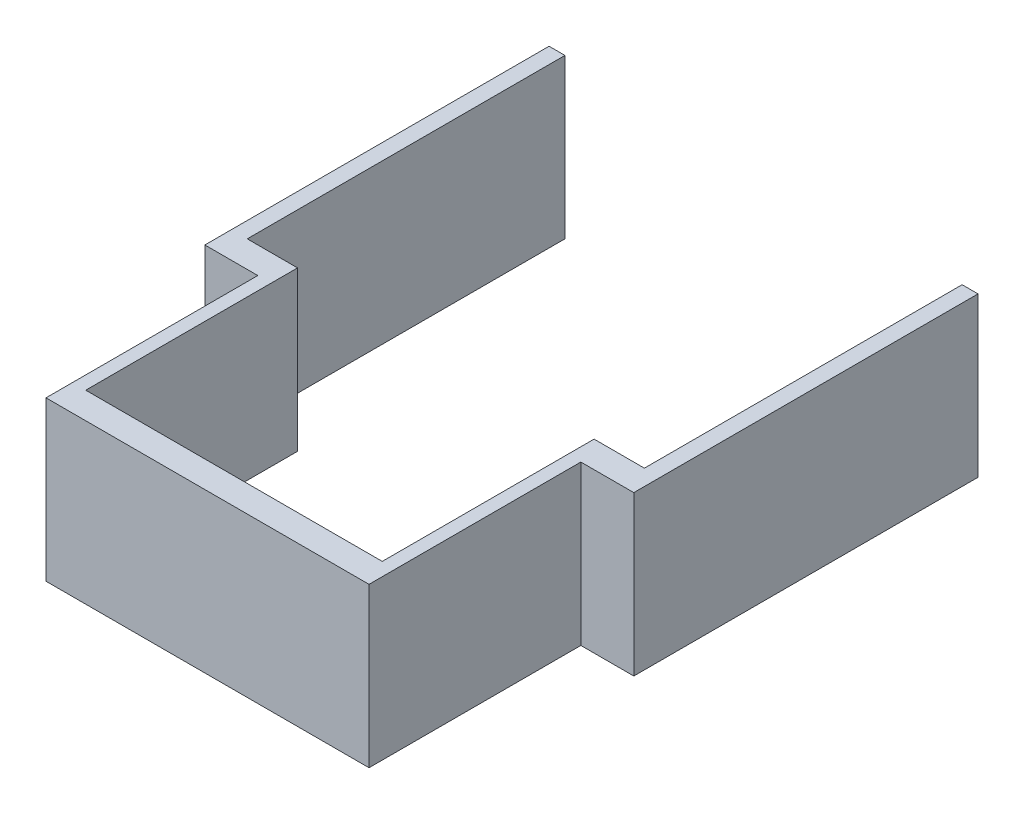
ISO-10303-21;
HEADER;
FILE_DESCRIPTION(('STEP AP214'),'2;1');
FILE_NAME('part.step','',(''),(''),'','','');
FILE_SCHEMA(('AUTOMOTIVE_DESIGN { 1 0 10303 214 1 1 1 1 }'));
ENDSEC;
DATA;
#1=APPLICATION_CONTEXT('core data for automotive mechanical design processes');
#2=APPLICATION_PROTOCOL_DEFINITION('international standard','automotive_design',2000,#1);
#3=PRODUCT_CONTEXT('',#1,'mechanical');
#4=PRODUCT('Part','Part','',(#3));
#5=PRODUCT_RELATED_PRODUCT_CATEGORY('part','',(#4));
#6=PRODUCT_DEFINITION_FORMATION('','',#4);
#7=PRODUCT_DEFINITION_CONTEXT('part definition',#1,'design');
#8=PRODUCT_DEFINITION('design','',#6,#7);
#9=PRODUCT_DEFINITION_SHAPE('','',#8);
#10=(LENGTH_UNIT() NAMED_UNIT(*) SI_UNIT(.MILLI.,.METRE.));
#11=(NAMED_UNIT(*) PLANE_ANGLE_UNIT() SI_UNIT($,.RADIAN.));
#12=(NAMED_UNIT(*) SI_UNIT($,.STERADIAN.) SOLID_ANGLE_UNIT());
#13=UNCERTAINTY_MEASURE_WITH_UNIT(LENGTH_MEASURE(1.E-05),#10,'distance_accuracy_value','');
#14=(GEOMETRIC_REPRESENTATION_CONTEXT(3) GLOBAL_UNCERTAINTY_ASSIGNED_CONTEXT((#13)) GLOBAL_UNIT_ASSIGNED_CONTEXT((#10,
#11,#12)) REPRESENTATION_CONTEXT('',''));
#15=CARTESIAN_POINT('',(0.,0.,0.));
#16=DIRECTION('',(0.,0.,1.));
#17=DIRECTION('',(1.,0.,0.));
#18=AXIS2_PLACEMENT_3D('',#15,#16,#17);
#19=CARTESIAN_POINT('',(0.,0.,0.));
#20=DIRECTION('',(0.,0.,1.));
#21=DIRECTION('',(1.,0.,0.));
#22=AXIS2_PLACEMENT_3D('',#19,#20,#21);
#23=PLANE('',#22);
#24=DIRECTION('',(0.,-1.,0.));
#25=VECTOR('',#24,1.);
#26=CARTESIAN_POINT('',(-39.9083668938455,-14.3559479553903,0.));
#27=LINE('',#26,#25);
#28=CARTESIAN_POINT('',(-39.9083668938455,15.6440520446097,0.));
#29=VERTEX_POINT('',#28);
#30=CARTESIAN_POINT('',(-39.9083668938455,-14.3559479553903,0.));
#31=VERTEX_POINT('',#30);
#32=EDGE_CURVE('E176',#29,#31,#27,.T.);
#33=ORIENTED_EDGE('',*,*,#32,.F.);
#34=DIRECTION('',(-1.,0.,0.));
#35=VECTOR('',#34,1.);
#36=CARTESIAN_POINT('',(-32.9083668938455,15.6440520446097,0.));
#37=LINE('',#36,#35);
#38=CARTESIAN_POINT('',(-30.4083668938455,15.6440520446097,0.));
#39=VERTEX_POINT('',#38);
#40=EDGE_CURVE('E267',#39,#29,#37,.T.);
#41=ORIENTED_EDGE('',*,*,#40,.F.);
#42=DIRECTION('',(0.,1.,0.));
#43=VECTOR('',#42,1.);
#44=CARTESIAN_POINT('',(-30.4083668938455,-14.3559479553903,0.));
#45=LINE('',#44,#43);
#46=CARTESIAN_POINT('',(-30.4083668938455,-14.3559479553903,0.));
#47=VERTEX_POINT('',#46);
#48=EDGE_CURVE('E225',#47,#39,#45,.T.);
#49=ORIENTED_EDGE('',*,*,#48,.F.);
#50=DIRECTION('',(1.,0.,0.));
#51=VECTOR('',#50,1.);
#52=CARTESIAN_POINT('',(-32.9083668938455,-14.3559479553903,0.));
#53=LINE('',#52,#51);
#54=EDGE_CURVE('E265',#31,#47,#53,.T.);
#55=ORIENTED_EDGE('',*,*,#54,.F.);
#56=EDGE_LOOP('',(#33,#41,#49,#55));
#57=FACE_BOUND('',#56,.T.);
#58=ADVANCED_FACE('F36',(#57),#23,.F.);
#59=DIRECTION('',(0.,1.,0.));
#60=VECTOR('',#59,1.);
#61=CARTESIAN_POINT('',(35.0916331061545,-14.3559479553903,0.));
#62=LINE('',#61,#60);
#63=CARTESIAN_POINT('',(35.0916331061545,-14.3559479553903,0.));
#64=VERTEX_POINT('',#63);
#65=CARTESIAN_POINT('',(35.0916331061545,15.6440520446097,0.));
#66=VERTEX_POINT('',#65);
#67=EDGE_CURVE('E186',#64,#66,#62,.T.);
#68=ORIENTED_EDGE('',*,*,#67,.F.);
#69=CARTESIAN_POINT('',(25.5916331061545,-14.3559479553903,0.));
#70=VERTEX_POINT('',#69);
#71=EDGE_CURVE('E245',#70,#64,#53,.T.);
#72=ORIENTED_EDGE('',*,*,#71,.F.);
#73=DIRECTION('',(0.,-1.,0.));
#74=VECTOR('',#73,1.);
#75=CARTESIAN_POINT('',(25.5916331061545,-14.3559479553903,0.));
#76=LINE('',#75,#74);
#77=CARTESIAN_POINT('',(25.5916331061545,15.6440520446097,0.));
#78=VERTEX_POINT('',#77);
#79=EDGE_CURVE('E230',#78,#70,#76,.T.);
#80=ORIENTED_EDGE('',*,*,#79,.F.);
#81=EDGE_CURVE('E258',#66,#78,#37,.T.);
#82=ORIENTED_EDGE('',*,*,#81,.F.);
#83=EDGE_LOOP('',(#68,#72,#80,#82));
#84=FACE_BOUND('',#83,.T.);
#85=ADVANCED_FACE('F303',(#84),#23,.F.);
#86=CARTESIAN_POINT('',(-32.9083668938455,15.6440520446097,45.));
#87=DIRECTION('',(1.,0.,0.));
#88=DIRECTION('',(0.,0.,-1.));
#89=AXIS2_PLACEMENT_3D('',#86,#87,#88);
#90=PLANE('',#89);
#91=DIRECTION('',(0.,1.,0.));
#92=VECTOR('',#91,1.);
#93=CARTESIAN_POINT('',(-32.9083668938455,15.6440520446097,5.));
#94=LINE('',#93,#92);
#95=CARTESIAN_POINT('',(-32.9083668938455,-14.3559479553903,5.00000000000002));
#96=VERTEX_POINT('',#95);
#97=CARTESIAN_POINT('',(-32.9083668938455,15.6440520446097,5.));
#98=VERTEX_POINT('',#97);
#99=EDGE_CURVE('E51',#96,#98,#94,.T.);
#100=ORIENTED_EDGE('',*,*,#99,.F.);
#101=DIRECTION('',(0.,0.,-1.));
#102=VECTOR('',#101,1.);
#103=CARTESIAN_POINT('',(-32.9083668938455,-14.3559479553903,45.));
#104=LINE('',#103,#102);
#105=CARTESIAN_POINT('',(-32.9083668938455,-14.3559479553903,45.));
#106=VERTEX_POINT('',#105);
#107=EDGE_CURVE('E11',#106,#96,#104,.T.);
#108=ORIENTED_EDGE('',*,*,#107,.F.);
#109=DIRECTION('',(0.,-1.,0.));
#110=VECTOR('',#109,1.);
#111=CARTESIAN_POINT('',(-32.9083668938455,15.6440520446097,45.));
#112=LINE('',#111,#110);
#113=CARTESIAN_POINT('',(-32.9083668938455,15.6440520446097,45.));
#114=VERTEX_POINT('',#113);
#115=EDGE_CURVE('E254',#114,#106,#112,.T.);
#116=ORIENTED_EDGE('',*,*,#115,.F.);
#117=DIRECTION('',(0.,0.,-1.));
#118=VECTOR('',#117,1.);
#119=CARTESIAN_POINT('',(-32.9083668938455,15.6440520446097,45.));
#120=LINE('',#119,#118);
#121=EDGE_CURVE('E264',#114,#98,#120,.T.);
#122=ORIENTED_EDGE('',*,*,#121,.T.);
#123=EDGE_LOOP('',(#100,#108,#116,#122));
#124=FACE_BOUND('',#123,.T.);
#125=ADVANCED_FACE('F38',(#124),#90,.F.);
#126=CARTESIAN_POINT('',(28.0916331061545,15.6440520446097,45.));
#127=DIRECTION('',(-1.,0.,0.));
#128=DIRECTION('',(0.,-1.,0.));
#129=AXIS2_PLACEMENT_3D('',#126,#127,#128);
#130=PLANE('',#129);
#131=DIRECTION('',(0.,-1.,0.));
#132=VECTOR('',#131,1.);
#133=CARTESIAN_POINT('',(28.0916331061545,-14.3559479553903,5.));
#134=LINE('',#133,#132);
#135=CARTESIAN_POINT('',(28.0916331061545,15.6440520446097,5.00000000000001));
#136=VERTEX_POINT('',#135);
#137=CARTESIAN_POINT('',(28.0916331061545,-14.3559479553903,5.));
#138=VERTEX_POINT('',#137);
#139=EDGE_CURVE('E58',#136,#138,#134,.T.);
#140=ORIENTED_EDGE('',*,*,#139,.F.);
#141=DIRECTION('',(0.,0.,-1.));
#142=VECTOR('',#141,1.);
#143=CARTESIAN_POINT('',(28.0916331061545,15.6440520446097,45.));
#144=LINE('',#143,#142);
#145=CARTESIAN_POINT('',(28.0916331061545,15.6440520446097,45.));
#146=VERTEX_POINT('',#145);
#147=EDGE_CURVE('E270',#146,#136,#144,.T.);
#148=ORIENTED_EDGE('',*,*,#147,.F.);
#149=DIRECTION('',(0.,1.,0.));
#150=VECTOR('',#149,1.);
#151=CARTESIAN_POINT('',(28.0916331061545,15.6440520446097,45.));
#152=LINE('',#151,#150);
#153=CARTESIAN_POINT('',(28.0916331061545,-14.3559479553903,45.));
#154=VERTEX_POINT('',#153);
#155=EDGE_CURVE('E260',#154,#146,#152,.T.);
#156=ORIENTED_EDGE('',*,*,#155,.F.);
#157=DIRECTION('',(0.,0.,-1.));
#158=VECTOR('',#157,1.);
#159=CARTESIAN_POINT('',(28.0916331061545,-14.3559479553903,45.));
#160=LINE('',#159,#158);
#161=EDGE_CURVE('E44',#154,#138,#160,.T.);
#162=ORIENTED_EDGE('',*,*,#161,.T.);
#163=EDGE_LOOP('',(#140,#148,#156,#162));
#164=FACE_BOUND('',#163,.T.);
#165=ADVANCED_FACE('F273',(#164),#130,.F.);
#166=CARTESIAN_POINT('',(-32.9083668938455,-14.3559479553903,45.));
#167=DIRECTION('',(0.,1.,0.));
#168=DIRECTION('',(0.,0.,1.));
#169=AXIS2_PLACEMENT_3D('',#166,#167,#168);
#170=PLANE('',#169);
#171=DIRECTION('',(0.,0.,1.));
#172=VECTOR('',#171,1.);
#173=CARTESIAN_POINT('',(-42.9083668938455,-14.3559479553903,5.));
#174=LINE('',#173,#172);
#175=CARTESIAN_POINT('',(-42.9083668938455,-14.3559479553903,-60.));
#176=VERTEX_POINT('',#175);
#177=CARTESIAN_POINT('',(-42.9083668938455,-14.3559479553903,5.));
#178=VERTEX_POINT('',#177);
#179=EDGE_CURVE('E160',#176,#178,#174,.T.);
#180=ORIENTED_EDGE('',*,*,#179,.F.);
#181=DIRECTION('',(-1.,0.,0.));
#182=VECTOR('',#181,1.);
#183=CARTESIAN_POINT('',(-42.9083668938455,-14.3559479553903,-60.));
#184=LINE('',#183,#182);
#185=CARTESIAN_POINT('',(-39.9083668938455,-14.3559479553903,-60.));
#186=VERTEX_POINT('',#185);
#187=EDGE_CURVE('E175',#186,#176,#184,.T.);
#188=ORIENTED_EDGE('',*,*,#187,.F.);
#189=DIRECTION('',(0.,0.,1.));
#190=VECTOR('',#189,1.);
#191=CARTESIAN_POINT('',(-39.9083668938455,-14.3559479553903,-60.));
#192=LINE('',#191,#190);
#193=EDGE_CURVE('E181',#186,#31,#192,.T.);
#194=ORIENTED_EDGE('',*,*,#193,.T.);
#195=ORIENTED_EDGE('',*,*,#54,.T.);
#196=DIRECTION('',(0.,0.,-1.));
#197=VECTOR('',#196,1.);
#198=CARTESIAN_POINT('',(-30.4083668938455,-14.3559479553903,40.));
#199=LINE('',#198,#197);
#200=CARTESIAN_POINT('',(-30.4083668938455,-14.3559479553903,40.));
#201=VERTEX_POINT('',#200);
#202=EDGE_CURVE('E242',#201,#47,#199,.T.);
#203=ORIENTED_EDGE('',*,*,#202,.F.);
#204=DIRECTION('',(-1.,0.,0.));
#205=VECTOR('',#204,1.);
#206=CARTESIAN_POINT('',(-30.4083668938455,-14.3559479553903,40.));
#207=LINE('',#206,#205);
#208=CARTESIAN_POINT('',(25.5916331061545,-14.3559479553903,40.));
#209=VERTEX_POINT('',#208);
#210=EDGE_CURVE('E236',#209,#201,#207,.T.);
#211=ORIENTED_EDGE('',*,*,#210,.F.);
#212=DIRECTION('',(0.,0.,-1.));
#213=VECTOR('',#212,1.);
#214=CARTESIAN_POINT('',(25.5916331061545,-14.3559479553903,40.));
#215=LINE('',#214,#213);
#216=EDGE_CURVE('E246',#209,#70,#215,.T.);
#217=ORIENTED_EDGE('',*,*,#216,.T.);
#218=ORIENTED_EDGE('',*,*,#71,.T.);
#219=DIRECTION('',(0.,0.,1.));
#220=VECTOR('',#219,1.);
#221=CARTESIAN_POINT('',(35.0916331061545,-14.3559479553903,-60.));
#222=LINE('',#221,#220);
#223=CARTESIAN_POINT('',(35.0916331061545,-14.3559479553903,-60.));
#224=VERTEX_POINT('',#223);
#225=EDGE_CURVE('E201',#224,#64,#222,.T.);
#226=ORIENTED_EDGE('',*,*,#225,.F.);
#227=DIRECTION('',(-1.,0.,0.));
#228=VECTOR('',#227,1.);
#229=CARTESIAN_POINT('',(38.0916331061545,-14.3559479553903,-60.));
#230=LINE('',#229,#228);
#231=CARTESIAN_POINT('',(38.0916331061545,-14.3559479553903,-60.));
#232=VERTEX_POINT('',#231);
#233=EDGE_CURVE('E190',#232,#224,#230,.T.);
#234=ORIENTED_EDGE('',*,*,#233,.F.);
#235=DIRECTION('',(0.,0.,-1.));
#236=VECTOR('',#235,1.);
#237=CARTESIAN_POINT('',(38.0916331061545,-14.3559479553903,5.));
#238=LINE('',#237,#236);
#239=CARTESIAN_POINT('',(38.0916331061545,-14.3559479553903,5.));
#240=VERTEX_POINT('',#239);
#241=EDGE_CURVE('E214',#240,#232,#238,.T.);
#242=ORIENTED_EDGE('',*,*,#241,.F.);
#243=DIRECTION('',(-1.,0.,0.));
#244=VECTOR('',#243,1.);
#245=CARTESIAN_POINT('',(38.0916331061545,-14.3559479553903,5.));
#246=LINE('',#245,#244);
#247=EDGE_CURVE('E222',#240,#138,#246,.T.);
#248=ORIENTED_EDGE('',*,*,#247,.T.);
#249=ORIENTED_EDGE('',*,*,#161,.F.);
#250=DIRECTION('',(1.,0.,0.));
#251=VECTOR('',#250,1.);
#252=CARTESIAN_POINT('',(-32.9083668938455,-14.3559479553903,45.));
#253=LINE('',#252,#251);
#254=EDGE_CURVE('E257',#106,#154,#253,.T.);
#255=ORIENTED_EDGE('',*,*,#254,.F.);
#256=ORIENTED_EDGE('',*,*,#107,.T.);
#257=DIRECTION('',(1.,0.,0.));
#258=VECTOR('',#257,1.);
#259=CARTESIAN_POINT('',(-42.9083668938455,-14.3559479553903,5.));
#260=LINE('',#259,#258);
#261=EDGE_CURVE('E205',#178,#96,#260,.T.);
#262=ORIENTED_EDGE('',*,*,#261,.F.);
#263=EDGE_LOOP('',(#180,#188,#194,#195,#203,#211,#217,#218,#226,#234,#242,#248,#249,#255,#256,#262));
#264=FACE_BOUND('',#263,.T.);
#265=ADVANCED_FACE('F276',(#264),#170,.F.);
#266=CARTESIAN_POINT('',(-32.9083668938455,15.6440520446097,45.));
#267=DIRECTION('',(0.,-1.,0.));
#268=DIRECTION('',(0.,0.,-1.));
#269=AXIS2_PLACEMENT_3D('',#266,#267,#268);
#270=PLANE('',#269);
#271=DIRECTION('',(1.,0.,0.));
#272=VECTOR('',#271,1.);
#273=CARTESIAN_POINT('',(-30.4083668938455,15.6440520446097,40.));
#274=LINE('',#273,#272);
#275=CARTESIAN_POINT('',(-30.4083668938455,15.6440520446097,40.));
#276=VERTEX_POINT('',#275);
#277=CARTESIAN_POINT('',(25.5916331061545,15.6440520446097,40.));
#278=VERTEX_POINT('',#277);
#279=EDGE_CURVE('E229',#276,#278,#274,.T.);
#280=ORIENTED_EDGE('',*,*,#279,.F.);
#281=DIRECTION('',(0.,0.,-1.));
#282=VECTOR('',#281,1.);
#283=CARTESIAN_POINT('',(-30.4083668938455,15.6440520446097,40.));
#284=LINE('',#283,#282);
#285=EDGE_CURVE('E239',#276,#39,#284,.T.);
#286=ORIENTED_EDGE('',*,*,#285,.T.);
#287=ORIENTED_EDGE('',*,*,#40,.T.);
#288=DIRECTION('',(0.,0.,1.));
#289=VECTOR('',#288,1.);
#290=CARTESIAN_POINT('',(-39.9083668938455,15.6440520446097,-60.));
#291=LINE('',#290,#289);
#292=CARTESIAN_POINT('',(-39.9083668938455,15.6440520446097,-60.));
#293=VERTEX_POINT('',#292);
#294=EDGE_CURVE('E167',#293,#29,#291,.T.);
#295=ORIENTED_EDGE('',*,*,#294,.F.);
#296=DIRECTION('',(1.,0.,0.));
#297=VECTOR('',#296,1.);
#298=CARTESIAN_POINT('',(-42.9083668938455,15.6440520446097,-60.));
#299=LINE('',#298,#297);
#300=CARTESIAN_POINT('',(-42.9083668938455,15.6440520446097,-60.));
#301=VERTEX_POINT('',#300);
#302=EDGE_CURVE('E163',#301,#293,#299,.T.);
#303=ORIENTED_EDGE('',*,*,#302,.F.);
#304=DIRECTION('',(0.,0.,-1.));
#305=VECTOR('',#304,1.);
#306=CARTESIAN_POINT('',(-42.9083668938455,15.6440520446097,5.));
#307=LINE('',#306,#305);
#308=CARTESIAN_POINT('',(-42.9083668938455,15.6440520446097,5.));
#309=VERTEX_POINT('',#308);
#310=EDGE_CURVE('E150',#309,#301,#307,.T.);
#311=ORIENTED_EDGE('',*,*,#310,.F.);
#312=DIRECTION('',(1.,0.,0.));
#313=VECTOR('',#312,1.);
#314=CARTESIAN_POINT('',(-42.9083668938455,15.6440520446097,5.));
#315=LINE('',#314,#313);
#316=EDGE_CURVE('E209',#309,#98,#315,.T.);
#317=ORIENTED_EDGE('',*,*,#316,.T.);
#318=ORIENTED_EDGE('',*,*,#121,.F.);
#319=DIRECTION('',(-1.,0.,0.));
#320=VECTOR('',#319,1.);
#321=CARTESIAN_POINT('',(-32.9083668938455,15.6440520446097,45.));
#322=LINE('',#321,#320);
#323=EDGE_CURVE('E262',#146,#114,#322,.T.);
#324=ORIENTED_EDGE('',*,*,#323,.F.);
#325=ORIENTED_EDGE('',*,*,#147,.T.);
#326=DIRECTION('',(-1.,0.,0.));
#327=VECTOR('',#326,1.);
#328=CARTESIAN_POINT('',(38.0916331061545,15.6440520446097,5.));
#329=LINE('',#328,#327);
#330=CARTESIAN_POINT('',(38.0916331061545,15.6440520446097,5.));
#331=VERTEX_POINT('',#330);
#332=EDGE_CURVE('E218',#331,#136,#329,.T.);
#333=ORIENTED_EDGE('',*,*,#332,.F.);
#334=DIRECTION('',(0.,0.,1.));
#335=VECTOR('',#334,1.);
#336=CARTESIAN_POINT('',(38.0916331061545,15.6440520446097,5.));
#337=LINE('',#336,#335);
#338=CARTESIAN_POINT('',(38.0916331061545,15.6440520446097,-60.));
#339=VERTEX_POINT('',#338);
#340=EDGE_CURVE('E216',#339,#331,#337,.T.);
#341=ORIENTED_EDGE('',*,*,#340,.F.);
#342=DIRECTION('',(1.,0.,0.));
#343=VECTOR('',#342,1.);
#344=CARTESIAN_POINT('',(38.0916331061545,15.6440520446097,-60.));
#345=LINE('',#344,#343);
#346=CARTESIAN_POINT('',(35.0916331061545,15.6440520446097,-60.));
#347=VERTEX_POINT('',#346);
#348=EDGE_CURVE('E194',#347,#339,#345,.T.);
#349=ORIENTED_EDGE('',*,*,#348,.F.);
#350=DIRECTION('',(0.,0.,1.));
#351=VECTOR('',#350,1.);
#352=CARTESIAN_POINT('',(35.0916331061545,15.6440520446097,-60.));
#353=LINE('',#352,#351);
#354=EDGE_CURVE('E197',#347,#66,#353,.T.);
#355=ORIENTED_EDGE('',*,*,#354,.T.);
#356=ORIENTED_EDGE('',*,*,#81,.T.);
#357=DIRECTION('',(0.,0.,-1.));
#358=VECTOR('',#357,1.);
#359=CARTESIAN_POINT('',(25.5916331061545,15.6440520446097,40.));
#360=LINE('',#359,#358);
#361=EDGE_CURVE('E249',#278,#78,#360,.T.);
#362=ORIENTED_EDGE('',*,*,#361,.F.);
#363=EDGE_LOOP('',(#280,#286,#287,#295,#303,#311,#317,#318,#324,#325,#333,#341,#349,#355,#356,#362));
#364=FACE_BOUND('',#363,.T.);
#365=ADVANCED_FACE('F165',(#364),#270,.F.);
#366=CARTESIAN_POINT('',(0.,0.,45.));
#367=DIRECTION('',(0.,0.,1.));
#368=DIRECTION('',(1.,0.,0.));
#369=AXIS2_PLACEMENT_3D('',#366,#367,#368);
#370=PLANE('',#369);
#371=ORIENTED_EDGE('',*,*,#115,.T.);
#372=ORIENTED_EDGE('',*,*,#254,.T.);
#373=ORIENTED_EDGE('',*,*,#155,.T.);
#374=ORIENTED_EDGE('',*,*,#323,.T.);
#375=EDGE_LOOP('',(#371,#372,#373,#374));
#376=FACE_BOUND('',#375,.T.);
#377=ADVANCED_FACE('F287',(#376),#370,.T.);
#378=CARTESIAN_POINT('',(-30.4083668938455,-14.3559479553903,40.));
#379=DIRECTION('',(-1.,0.,0.));
#380=DIRECTION('',(0.,0.,1.));
#381=AXIS2_PLACEMENT_3D('',#378,#379,#380);
#382=PLANE('',#381);
#383=ORIENTED_EDGE('',*,*,#48,.T.);
#384=ORIENTED_EDGE('',*,*,#285,.F.);
#385=DIRECTION('',(0.,1.,0.));
#386=VECTOR('',#385,1.);
#387=CARTESIAN_POINT('',(-30.4083668938455,-14.3559479553903,40.));
#388=LINE('',#387,#386);
#389=EDGE_CURVE('E226',#201,#276,#388,.T.);
#390=ORIENTED_EDGE('',*,*,#389,.F.);
#391=ORIENTED_EDGE('',*,*,#202,.T.);
#392=EDGE_LOOP('',(#383,#384,#390,#391));
#393=FACE_BOUND('',#392,.T.);
#394=ADVANCED_FACE('F334',(#393),#382,.F.);
#395=CARTESIAN_POINT('',(25.5916331061545,-14.3559479553903,40.));
#396=DIRECTION('',(1.,0.,0.));
#397=DIRECTION('',(0.,1.,0.));
#398=AXIS2_PLACEMENT_3D('',#395,#396,#397);
#399=PLANE('',#398);
#400=ORIENTED_EDGE('',*,*,#79,.T.);
#401=ORIENTED_EDGE('',*,*,#216,.F.);
#402=DIRECTION('',(0.,-1.,0.));
#403=VECTOR('',#402,1.);
#404=CARTESIAN_POINT('',(25.5916331061545,-14.3559479553903,40.));
#405=LINE('',#404,#403);
#406=EDGE_CURVE('E233',#278,#209,#405,.T.);
#407=ORIENTED_EDGE('',*,*,#406,.F.);
#408=ORIENTED_EDGE('',*,*,#361,.T.);
#409=EDGE_LOOP('',(#400,#401,#407,#408));
#410=FACE_BOUND('',#409,.T.);
#411=ADVANCED_FACE('F340',(#410),#399,.F.);
#412=CARTESIAN_POINT('',(0.,0.,40.));
#413=DIRECTION('',(0.,0.,-1.));
#414=DIRECTION('',(-1.,0.,0.));
#415=AXIS2_PLACEMENT_3D('',#412,#413,#414);
#416=PLANE('',#415);
#417=ORIENTED_EDGE('',*,*,#389,.T.);
#418=ORIENTED_EDGE('',*,*,#279,.T.);
#419=ORIENTED_EDGE('',*,*,#406,.T.);
#420=ORIENTED_EDGE('',*,*,#210,.T.);
#421=EDGE_LOOP('',(#417,#418,#419,#420));
#422=FACE_BOUND('',#421,.T.);
#423=ADVANCED_FACE('F347',(#422),#416,.T.);
#424=CARTESIAN_POINT('',(38.0916331061545,-14.3559479553903,5.));
#425=DIRECTION('',(0.,0.,-1.));
#426=DIRECTION('',(-1.,0.,0.));
#427=AXIS2_PLACEMENT_3D('',#424,#425,#426);
#428=PLANE('',#427);
#429=ORIENTED_EDGE('',*,*,#139,.T.);
#430=ORIENTED_EDGE('',*,*,#247,.F.);
#431=DIRECTION('',(0.,-1.,0.));
#432=VECTOR('',#431,1.);
#433=CARTESIAN_POINT('',(38.0916331061545,-14.3559479553903,5.));
#434=LINE('',#433,#432);
#435=EDGE_CURVE('E211',#331,#240,#434,.T.);
#436=ORIENTED_EDGE('',*,*,#435,.F.);
#437=ORIENTED_EDGE('',*,*,#332,.T.);
#438=EDGE_LOOP('',(#429,#430,#436,#437));
#439=FACE_BOUND('',#438,.T.);
#440=ADVANCED_FACE('F280',(#439),#428,.F.);
#441=CARTESIAN_POINT('',(38.0916331061545,0.,0.));
#442=DIRECTION('',(-1.,0.,0.));
#443=DIRECTION('',(0.,0.,1.));
#444=AXIS2_PLACEMENT_3D('',#441,#442,#443);
#445=PLANE('',#444);
#446=ORIENTED_EDGE('',*,*,#435,.T.);
#447=ORIENTED_EDGE('',*,*,#241,.T.);
#448=DIRECTION('',(0.,-1.,0.));
#449=VECTOR('',#448,1.);
#450=CARTESIAN_POINT('',(38.0916331061545,-14.3559479553903,-60.));
#451=LINE('',#450,#449);
#452=EDGE_CURVE('E187',#339,#232,#451,.T.);
#453=ORIENTED_EDGE('',*,*,#452,.F.);
#454=ORIENTED_EDGE('',*,*,#340,.T.);
#455=EDGE_LOOP('',(#446,#447,#453,#454));
#456=FACE_BOUND('',#455,.T.);
#457=ADVANCED_FACE('F292',(#456),#445,.F.);
#458=CARTESIAN_POINT('',(-42.9083668938455,15.6440520446097,5.));
#459=DIRECTION('',(0.,0.,-1.));
#460=DIRECTION('',(0.,1.,0.));
#461=AXIS2_PLACEMENT_3D('',#458,#459,#460);
#462=PLANE('',#461);
#463=ORIENTED_EDGE('',*,*,#99,.T.);
#464=ORIENTED_EDGE('',*,*,#316,.F.);
#465=DIRECTION('',(0.,1.,0.));
#466=VECTOR('',#465,1.);
#467=CARTESIAN_POINT('',(-42.9083668938455,15.6440520446097,5.));
#468=LINE('',#467,#466);
#469=EDGE_CURVE('E156',#178,#309,#468,.T.);
#470=ORIENTED_EDGE('',*,*,#469,.F.);
#471=ORIENTED_EDGE('',*,*,#261,.T.);
#472=EDGE_LOOP('',(#463,#464,#470,#471));
#473=FACE_BOUND('',#472,.T.);
#474=ADVANCED_FACE('F290',(#473),#462,.F.);
#475=CARTESIAN_POINT('',(-42.9083668938455,0.,0.));
#476=DIRECTION('',(1.,0.,0.));
#477=DIRECTION('',(0.,0.,-1.));
#478=AXIS2_PLACEMENT_3D('',#475,#476,#477);
#479=PLANE('',#478);
#480=ORIENTED_EDGE('',*,*,#469,.T.);
#481=ORIENTED_EDGE('',*,*,#310,.T.);
#482=DIRECTION('',(0.,1.,0.));
#483=VECTOR('',#482,1.);
#484=CARTESIAN_POINT('',(-42.9083668938455,-14.3559479553903,-60.));
#485=LINE('',#484,#483);
#486=EDGE_CURVE('E154',#176,#301,#485,.T.);
#487=ORIENTED_EDGE('',*,*,#486,.F.);
#488=ORIENTED_EDGE('',*,*,#179,.T.);
#489=EDGE_LOOP('',(#480,#481,#487,#488));
#490=FACE_BOUND('',#489,.T.);
#491=ADVANCED_FACE('F152',(#490),#479,.F.);
#492=CARTESIAN_POINT('',(35.0916331061545,-14.3559479553903,-60.));
#493=DIRECTION('',(1.,0.,0.));
#494=DIRECTION('',(0.,0.,-1.));
#495=AXIS2_PLACEMENT_3D('',#492,#493,#494);
#496=PLANE('',#495);
#497=ORIENTED_EDGE('',*,*,#67,.T.);
#498=ORIENTED_EDGE('',*,*,#354,.F.);
#499=DIRECTION('',(0.,1.,0.));
#500=VECTOR('',#499,1.);
#501=CARTESIAN_POINT('',(35.0916331061545,-14.3559479553903,-60.));
#502=LINE('',#501,#500);
#503=EDGE_CURVE('E192',#224,#347,#502,.T.);
#504=ORIENTED_EDGE('',*,*,#503,.F.);
#505=ORIENTED_EDGE('',*,*,#225,.T.);
#506=EDGE_LOOP('',(#497,#498,#504,#505));
#507=FACE_BOUND('',#506,.T.);
#508=ADVANCED_FACE('F298',(#507),#496,.F.);
#509=CARTESIAN_POINT('',(0.,0.,-60.));
#510=DIRECTION('',(0.,0.,1.));
#511=DIRECTION('',(1.,0.,0.));
#512=AXIS2_PLACEMENT_3D('',#509,#510,#511);
#513=PLANE('',#512);
#514=ORIENTED_EDGE('',*,*,#452,.T.);
#515=ORIENTED_EDGE('',*,*,#233,.T.);
#516=ORIENTED_EDGE('',*,*,#503,.T.);
#517=ORIENTED_EDGE('',*,*,#348,.T.);
#518=EDGE_LOOP('',(#514,#515,#516,#517));
#519=FACE_BOUND('',#518,.T.);
#520=ADVANCED_FACE('F381',(#519),#513,.F.);
#521=CARTESIAN_POINT('',(-39.9083668938455,-14.3559479553903,-60.));
#522=DIRECTION('',(-1.,0.,0.));
#523=DIRECTION('',(0.,0.,1.));
#524=AXIS2_PLACEMENT_3D('',#521,#522,#523);
#525=PLANE('',#524);
#526=ORIENTED_EDGE('',*,*,#32,.T.);
#527=ORIENTED_EDGE('',*,*,#193,.F.);
#528=DIRECTION('',(0.,-1.,0.));
#529=VECTOR('',#528,1.);
#530=CARTESIAN_POINT('',(-39.9083668938455,-14.3559479553903,-60.));
#531=LINE('',#530,#529);
#532=EDGE_CURVE('E170',#293,#186,#531,.T.);
#533=ORIENTED_EDGE('',*,*,#532,.F.);
#534=ORIENTED_EDGE('',*,*,#294,.T.);
#535=EDGE_LOOP('',(#526,#527,#533,#534));
#536=FACE_BOUND('',#535,.T.);
#537=ADVANCED_FACE('F390',(#536),#525,.F.);
#538=CARTESIAN_POINT('',(0.,0.,-60.));
#539=DIRECTION('',(0.,0.,-1.));
#540=DIRECTION('',(-1.,0.,0.));
#541=AXIS2_PLACEMENT_3D('',#538,#539,#540);
#542=PLANE('',#541);
#543=ORIENTED_EDGE('',*,*,#486,.T.);
#544=ORIENTED_EDGE('',*,*,#302,.T.);
#545=ORIENTED_EDGE('',*,*,#532,.T.);
#546=ORIENTED_EDGE('',*,*,#187,.T.);
#547=EDGE_LOOP('',(#543,#544,#545,#546));
#548=FACE_BOUND('',#547,.T.);
#549=ADVANCED_FACE('F173',(#548),#542,.T.);
#550=CLOSED_SHELL('',(#58,#85,#125,#165,#265,#365,#377,#394,#411,#423,#440,#457,#474,#491,#508,
#520,#537,#549));
#551=MANIFOLD_SOLID_BREP('B2',#550);
#552=ADVANCED_BREP_SHAPE_REPRESENTATION('',(#18,#551),#14);
#553=SHAPE_DEFINITION_REPRESENTATION(#9,#552);
ENDSEC;
END-ISO-10303-21;
